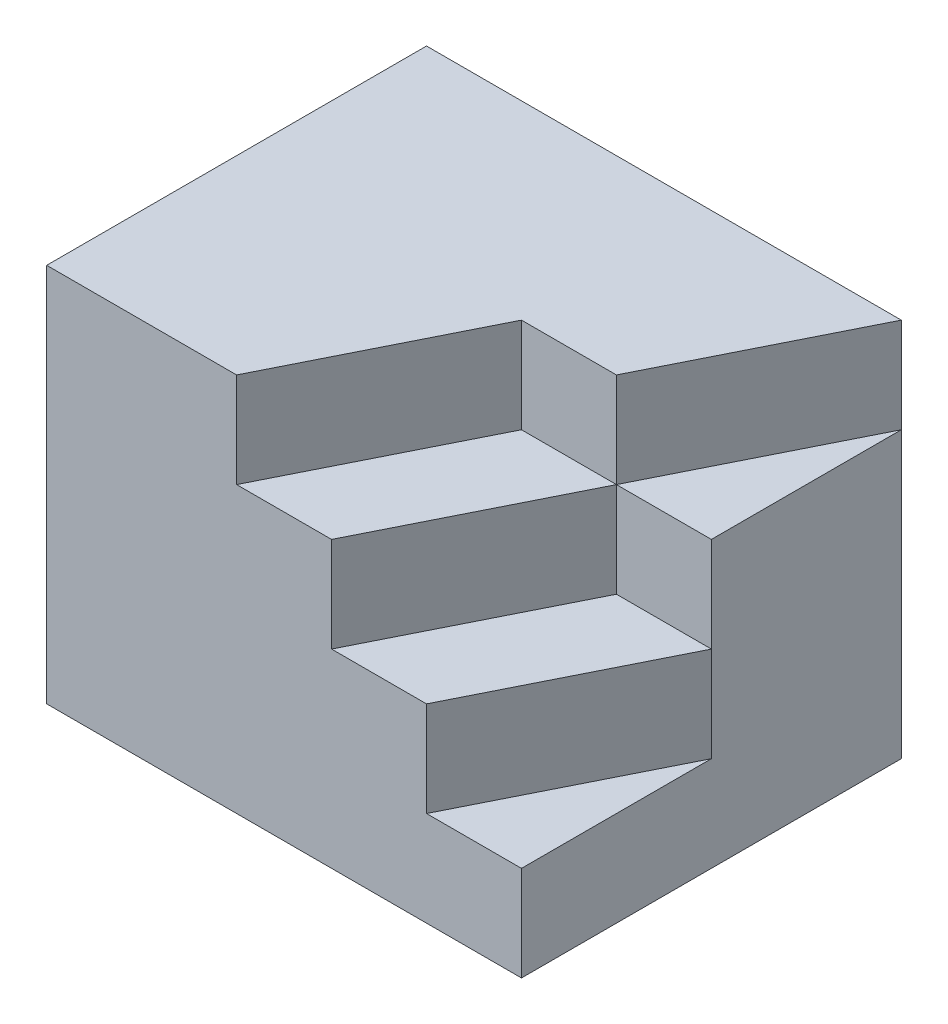
ISO-10303-21;
HEADER;
FILE_DESCRIPTION(('STEP AP214'),'2;1');
FILE_NAME('part.step','',(''),(''),'','','');
FILE_SCHEMA(('AUTOMOTIVE_DESIGN { 1 0 10303 214 1 1 1 1 }'));
ENDSEC;
DATA;
#1=APPLICATION_CONTEXT('core data for automotive mechanical design processes');
#2=APPLICATION_PROTOCOL_DEFINITION('international standard','automotive_design',2000,#1);
#3=PRODUCT_CONTEXT('',#1,'mechanical');
#4=PRODUCT('Part','Part','',(#3));
#5=PRODUCT_RELATED_PRODUCT_CATEGORY('part','',(#4));
#6=PRODUCT_DEFINITION_FORMATION('','',#4);
#7=PRODUCT_DEFINITION_CONTEXT('part definition',#1,'design');
#8=PRODUCT_DEFINITION('design','',#6,#7);
#9=PRODUCT_DEFINITION_SHAPE('','',#8);
#10=(LENGTH_UNIT() NAMED_UNIT(*) SI_UNIT(.MILLI.,.METRE.));
#11=(NAMED_UNIT(*) PLANE_ANGLE_UNIT() SI_UNIT($,.RADIAN.));
#12=(NAMED_UNIT(*) SI_UNIT($,.STERADIAN.) SOLID_ANGLE_UNIT());
#13=UNCERTAINTY_MEASURE_WITH_UNIT(LENGTH_MEASURE(1.E-05),#10,'distance_accuracy_value','');
#14=(GEOMETRIC_REPRESENTATION_CONTEXT(3) GLOBAL_UNCERTAINTY_ASSIGNED_CONTEXT((#13)) GLOBAL_UNIT_ASSIGNED_CONTEXT((#10,
#11,#12)) REPRESENTATION_CONTEXT('',''));
#15=CARTESIAN_POINT('',(0.,0.,0.));
#16=DIRECTION('',(0.,0.,1.));
#17=DIRECTION('',(1.,0.,0.));
#18=AXIS2_PLACEMENT_3D('',#15,#16,#17);
#19=CARTESIAN_POINT('',(-25.,40.,20.));
#20=DIRECTION('',(0.,0.,-1.));
#21=DIRECTION('',(-1.,0.,0.));
#22=AXIS2_PLACEMENT_3D('',#19,#20,#21);
#23=PLANE('',#22);
#24=DIRECTION('',(0.,-1.,0.));
#25=VECTOR('',#24,1.);
#26=CARTESIAN_POINT('',(-5.,146.872930440884,20.));
#27=LINE('',#26,#25);
#28=CARTESIAN_POINT('',(-5.,40.,20.));
#29=VERTEX_POINT('',#28);
#30=CARTESIAN_POINT('',(-5.,30.,20.));
#31=VERTEX_POINT('',#30);
#32=EDGE_CURVE('E126',#29,#31,#27,.T.);
#33=ORIENTED_EDGE('',*,*,#32,.F.);
#34=DIRECTION('',(1.,0.,0.));
#35=VECTOR('',#34,1.);
#36=CARTESIAN_POINT('',(-25.,40.,20.));
#37=LINE('',#36,#35);
#38=CARTESIAN_POINT('',(-25.,40.,20.));
#39=VERTEX_POINT('',#38);
#40=EDGE_CURVE('E138',#39,#29,#37,.T.);
#41=ORIENTED_EDGE('',*,*,#40,.F.);
#42=DIRECTION('',(0.,-1.,0.));
#43=VECTOR('',#42,1.);
#44=CARTESIAN_POINT('',(-25.,40.,20.));
#45=LINE('',#44,#43);
#46=CARTESIAN_POINT('',(-25.,0.,20.));
#47=VERTEX_POINT('',#46);
#48=EDGE_CURVE('E148',#39,#47,#45,.T.);
#49=ORIENTED_EDGE('',*,*,#48,.T.);
#50=DIRECTION('',(1.,0.,0.));
#51=VECTOR('',#50,1.);
#52=CARTESIAN_POINT('',(-25.,0.,20.));
#53=LINE('',#52,#51);
#54=CARTESIAN_POINT('',(25.,0.,20.));
#55=VERTEX_POINT('',#54);
#56=EDGE_CURVE('E162',#47,#55,#53,.T.);
#57=ORIENTED_EDGE('',*,*,#56,.T.);
#58=DIRECTION('',(0.,-1.,0.));
#59=VECTOR('',#58,1.);
#60=CARTESIAN_POINT('',(25.,40.,20.));
#61=LINE('',#60,#59);
#62=CARTESIAN_POINT('',(25.,10.,20.));
#63=VERTEX_POINT('',#62);
#64=EDGE_CURVE('E146',#63,#55,#61,.T.);
#65=ORIENTED_EDGE('',*,*,#64,.F.);
#66=DIRECTION('',(1.,0.,0.));
#67=VECTOR('',#66,1.);
#68=CARTESIAN_POINT('',(15.,10.,20.));
#69=LINE('',#68,#67);
#70=CARTESIAN_POINT('',(15.,10.,20.));
#71=VERTEX_POINT('',#70);
#72=EDGE_CURVE('E269',#71,#63,#69,.T.);
#73=ORIENTED_EDGE('',*,*,#72,.F.);
#74=DIRECTION('',(0.,1.,0.));
#75=VECTOR('',#74,1.);
#76=CARTESIAN_POINT('',(15.,10.,20.));
#77=LINE('',#76,#75);
#78=CARTESIAN_POINT('',(15.,20.,20.));
#79=VERTEX_POINT('',#78);
#80=EDGE_CURVE('E158',#71,#79,#77,.T.);
#81=ORIENTED_EDGE('',*,*,#80,.T.);
#82=DIRECTION('',(1.,0.,0.));
#83=VECTOR('',#82,1.);
#84=CARTESIAN_POINT('',(0.,20.,20.));
#85=LINE('',#84,#83);
#86=CARTESIAN_POINT('',(5.,20.,20.));
#87=VERTEX_POINT('',#86);
#88=EDGE_CURVE('E56',#87,#79,#85,.T.);
#89=ORIENTED_EDGE('',*,*,#88,.F.);
#90=DIRECTION('',(0.,1.,0.));
#91=VECTOR('',#90,1.);
#92=CARTESIAN_POINT('',(5.,20.,20.));
#93=LINE('',#92,#91);
#94=CARTESIAN_POINT('',(5.,30.,20.));
#95=VERTEX_POINT('',#94);
#96=EDGE_CURVE('E267',#87,#95,#93,.T.);
#97=ORIENTED_EDGE('',*,*,#96,.T.);
#98=DIRECTION('',(-1.,0.,0.));
#99=VECTOR('',#98,1.);
#100=CARTESIAN_POINT('',(-5.,30.,20.));
#101=LINE('',#100,#99);
#102=EDGE_CURVE('E48',#95,#31,#101,.T.);
#103=ORIENTED_EDGE('',*,*,#102,.T.);
#104=EDGE_LOOP('',(#33,#41,#49,#57,#65,#73,#81,#89,#97,#103));
#105=FACE_BOUND('',#104,.T.);
#106=ADVANCED_FACE('F33',(#105),#23,.F.);
#107=CARTESIAN_POINT('',(0.,40.,0.));
#108=DIRECTION('',(0.,-1.,0.));
#109=DIRECTION('',(0.,0.,-1.));
#110=AXIS2_PLACEMENT_3D('',#107,#108,#109);
#111=PLANE('',#110);
#112=DIRECTION('',(0.447213595499958,0.,-0.894427190999916));
#113=VECTOR('',#112,1.);
#114=CARTESIAN_POINT('',(5.,40.,0.));
#115=LINE('',#114,#113);
#116=CARTESIAN_POINT('',(5.,40.,0.));
#117=VERTEX_POINT('',#116);
#118=EDGE_CURVE('E122',#29,#117,#115,.T.);
#119=ORIENTED_EDGE('',*,*,#118,.T.);
#120=DIRECTION('',(1.,0.,0.));
#121=VECTOR('',#120,1.);
#122=CARTESIAN_POINT('',(15.,40.,0.));
#123=LINE('',#122,#121);
#124=CARTESIAN_POINT('',(15.,40.,0.));
#125=VERTEX_POINT('',#124);
#126=EDGE_CURVE('E132',#117,#125,#123,.T.);
#127=ORIENTED_EDGE('',*,*,#126,.T.);
#128=DIRECTION('',(-0.447213595499958,0.,0.894427190999916));
#129=VECTOR('',#128,1.);
#130=CARTESIAN_POINT('',(12.,40.,6.));
#131=LINE('',#130,#129);
#132=CARTESIAN_POINT('',(25.,40.,-20.));
#133=VERTEX_POINT('',#132);
#134=EDGE_CURVE('E256',#133,#125,#131,.T.);
#135=ORIENTED_EDGE('',*,*,#134,.F.);
#136=DIRECTION('',(-1.,0.,0.));
#137=VECTOR('',#136,1.);
#138=CARTESIAN_POINT('',(-25.,40.,-20.));
#139=LINE('',#138,#137);
#140=CARTESIAN_POINT('',(-25.,40.,-20.));
#141=VERTEX_POINT('',#140);
#142=EDGE_CURVE('E150',#133,#141,#139,.T.);
#143=ORIENTED_EDGE('',*,*,#142,.T.);
#144=DIRECTION('',(0.,0.,1.));
#145=VECTOR('',#144,1.);
#146=CARTESIAN_POINT('',(-25.,40.,20.));
#147=LINE('',#146,#145);
#148=EDGE_CURVE('E144',#141,#39,#147,.T.);
#149=ORIENTED_EDGE('',*,*,#148,.T.);
#150=ORIENTED_EDGE('',*,*,#40,.T.);
#151=EDGE_LOOP('',(#119,#127,#135,#143,#149,#150));
#152=FACE_BOUND('',#151,.T.);
#153=ADVANCED_FACE('F142',(#152),#111,.F.);
#154=CARTESIAN_POINT('',(12.,20.,6.));
#155=DIRECTION('',(-0.894427190999916,0.,-0.447213595499958));
#156=DIRECTION('',(-0.447213595499958,0.,0.894427190999916));
#157=AXIS2_PLACEMENT_3D('',#154,#155,#156);
#158=PLANE('',#157);
#159=DIRECTION('',(0.,-1.,0.));
#160=VECTOR('',#159,1.);
#161=CARTESIAN_POINT('',(15.,146.872930440884,0.));
#162=LINE('',#161,#160);
#163=CARTESIAN_POINT('',(15.,30.,0.));
#164=VERTEX_POINT('',#163);
#165=EDGE_CURVE('E238',#125,#164,#162,.T.);
#166=ORIENTED_EDGE('',*,*,#165,.T.);
#167=DIRECTION('',(-0.447213595499958,0.,0.894427190999916));
#168=VECTOR('',#167,1.);
#169=CARTESIAN_POINT('',(12.,30.,6.));
#170=LINE('',#169,#168);
#171=CARTESIAN_POINT('',(25.,30.,-20.));
#172=VERTEX_POINT('',#171);
#173=EDGE_CURVE('E253',#172,#164,#170,.T.);
#174=ORIENTED_EDGE('',*,*,#173,.F.);
#175=DIRECTION('',(0.,-1.,0.));
#176=VECTOR('',#175,1.);
#177=CARTESIAN_POINT('',(25.,40.,-20.));
#178=LINE('',#177,#176);
#179=EDGE_CURVE('E11',#133,#172,#178,.T.);
#180=ORIENTED_EDGE('',*,*,#179,.F.);
#181=ORIENTED_EDGE('',*,*,#134,.T.);
#182=EDGE_LOOP('',(#166,#174,#180,#181));
#183=FACE_BOUND('',#182,.T.);
#184=ADVANCED_FACE('F202',(#183),#158,.F.);
#185=CARTESIAN_POINT('',(25.,40.,20.));
#186=DIRECTION('',(-1.,0.,0.));
#187=DIRECTION('',(0.,0.,1.));
#188=AXIS2_PLACEMENT_3D('',#185,#186,#187);
#189=PLANE('',#188);
#190=DIRECTION('',(0.,0.,-1.));
#191=VECTOR('',#190,1.);
#192=CARTESIAN_POINT('',(25.,30.,0.));
#193=LINE('',#192,#191);
#194=CARTESIAN_POINT('',(25.,30.,0.));
#195=VERTEX_POINT('',#194);
#196=EDGE_CURVE('E251',#195,#172,#193,.T.);
#197=ORIENTED_EDGE('',*,*,#196,.F.);
#198=DIRECTION('',(0.,1.,0.));
#199=VECTOR('',#198,1.);
#200=CARTESIAN_POINT('',(25.,20.,0.));
#201=LINE('',#200,#199);
#202=CARTESIAN_POINT('',(25.,20.,0.));
#203=VERTEX_POINT('',#202);
#204=EDGE_CURVE('E265',#203,#195,#201,.T.);
#205=ORIENTED_EDGE('',*,*,#204,.F.);
#206=DIRECTION('',(0.,1.,0.));
#207=VECTOR('',#206,1.);
#208=CARTESIAN_POINT('',(25.,10.,0.));
#209=LINE('',#208,#207);
#210=CARTESIAN_POINT('',(25.,10.,0.));
#211=VERTEX_POINT('',#210);
#212=EDGE_CURVE('E280',#211,#203,#209,.T.);
#213=ORIENTED_EDGE('',*,*,#212,.F.);
#214=DIRECTION('',(0.,0.,-1.));
#215=VECTOR('',#214,1.);
#216=CARTESIAN_POINT('',(25.,10.,20.));
#217=LINE('',#216,#215);
#218=EDGE_CURVE('E185',#63,#211,#217,.T.);
#219=ORIENTED_EDGE('',*,*,#218,.F.);
#220=ORIENTED_EDGE('',*,*,#64,.T.);
#221=DIRECTION('',(0.,0.,-1.));
#222=VECTOR('',#221,1.);
#223=CARTESIAN_POINT('',(25.,0.,20.));
#224=LINE('',#223,#222);
#225=CARTESIAN_POINT('',(25.,0.,-20.));
#226=VERTEX_POINT('',#225);
#227=EDGE_CURVE('E154',#55,#226,#224,.T.);
#228=ORIENTED_EDGE('',*,*,#227,.T.);
#229=EDGE_CURVE('E41',#172,#226,#178,.T.);
#230=ORIENTED_EDGE('',*,*,#229,.F.);
#231=EDGE_LOOP('',(#197,#205,#213,#219,#220,#228,#230));
#232=FACE_BOUND('',#231,.T.);
#233=ADVANCED_FACE('F35',(#232),#189,.F.);
#234=CARTESIAN_POINT('',(0.,20.,0.));
#235=DIRECTION('',(0.,0.,-1.));
#236=DIRECTION('',(-1.,0.,0.));
#237=AXIS2_PLACEMENT_3D('',#234,#235,#236);
#238=PLANE('',#237);
#239=DIRECTION('',(-1.,0.,0.));
#240=VECTOR('',#239,1.);
#241=CARTESIAN_POINT('',(0.,30.,0.));
#242=LINE('',#241,#240);
#243=EDGE_CURVE('E140',#195,#164,#242,.T.);
#244=ORIENTED_EDGE('',*,*,#243,.T.);
#245=DIRECTION('',(0.,1.,0.));
#246=VECTOR('',#245,1.);
#247=CARTESIAN_POINT('',(15.,20.,0.));
#248=LINE('',#247,#246);
#249=CARTESIAN_POINT('',(15.,20.,0.));
#250=VERTEX_POINT('',#249);
#251=EDGE_CURVE('E270',#250,#164,#248,.T.);
#252=ORIENTED_EDGE('',*,*,#251,.F.);
#253=DIRECTION('',(-1.,0.,0.));
#254=VECTOR('',#253,1.);
#255=CARTESIAN_POINT('',(0.,20.,0.));
#256=LINE('',#255,#254);
#257=EDGE_CURVE('E259',#203,#250,#256,.T.);
#258=ORIENTED_EDGE('',*,*,#257,.F.);
#259=ORIENTED_EDGE('',*,*,#204,.T.);
#260=EDGE_LOOP('',(#244,#252,#258,#259));
#261=FACE_BOUND('',#260,.T.);
#262=ADVANCED_FACE('F207',(#261),#238,.F.);
#263=CARTESIAN_POINT('',(25.,10.,0.));
#264=DIRECTION('',(-0.894427190999916,0.,-0.447213595499958));
#265=DIRECTION('',(-0.447213595499958,0.,0.894427190999916));
#266=AXIS2_PLACEMENT_3D('',#263,#264,#265);
#267=PLANE('',#266);
#268=DIRECTION('',(0.447213595499958,0.,-0.894427190999916));
#269=VECTOR('',#268,1.);
#270=CARTESIAN_POINT('',(20.,20.,10.));
#271=LINE('',#270,#269);
#272=EDGE_CURVE('E257',#79,#203,#271,.T.);
#273=ORIENTED_EDGE('',*,*,#272,.F.);
#274=ORIENTED_EDGE('',*,*,#80,.F.);
#275=DIRECTION('',(-0.447213595499958,0.,0.894427190999916));
#276=VECTOR('',#275,1.);
#277=CARTESIAN_POINT('',(25.,10.,0.));
#278=LINE('',#277,#276);
#279=EDGE_CURVE('E277',#211,#71,#278,.T.);
#280=ORIENTED_EDGE('',*,*,#279,.F.);
#281=ORIENTED_EDGE('',*,*,#212,.T.);
#282=EDGE_LOOP('',(#273,#274,#280,#281));
#283=FACE_BOUND('',#282,.T.);
#284=ADVANCED_FACE('F196',(#283),#267,.F.);
#285=CARTESIAN_POINT('',(-25.,40.,-20.));
#286=DIRECTION('',(0.,0.,1.));
#287=DIRECTION('',(1.,0.,0.));
#288=AXIS2_PLACEMENT_3D('',#285,#286,#287);
#289=PLANE('',#288);
#290=DIRECTION('',(-1.,0.,0.));
#291=VECTOR('',#290,1.);
#292=CARTESIAN_POINT('',(-25.,0.,-20.));
#293=LINE('',#292,#291);
#294=CARTESIAN_POINT('',(-25.,0.,-20.));
#295=VERTEX_POINT('',#294);
#296=EDGE_CURVE('E157',#226,#295,#293,.T.);
#297=ORIENTED_EDGE('',*,*,#296,.T.);
#298=DIRECTION('',(0.,-1.,0.));
#299=VECTOR('',#298,1.);
#300=CARTESIAN_POINT('',(-25.,40.,-20.));
#301=LINE('',#300,#299);
#302=EDGE_CURVE('E165',#141,#295,#301,.T.);
#303=ORIENTED_EDGE('',*,*,#302,.F.);
#304=ORIENTED_EDGE('',*,*,#142,.F.);
#305=ORIENTED_EDGE('',*,*,#179,.T.);
#306=ORIENTED_EDGE('',*,*,#229,.T.);
#307=EDGE_LOOP('',(#297,#303,#304,#305,#306));
#308=FACE_BOUND('',#307,.T.);
#309=ADVANCED_FACE('F173',(#308),#289,.F.);
#310=CARTESIAN_POINT('',(-25.,40.,20.));
#311=DIRECTION('',(1.,0.,0.));
#312=DIRECTION('',(0.,0.,-1.));
#313=AXIS2_PLACEMENT_3D('',#310,#311,#312);
#314=PLANE('',#313);
#315=DIRECTION('',(0.,0.,1.));
#316=VECTOR('',#315,1.);
#317=CARTESIAN_POINT('',(-25.,0.,20.));
#318=LINE('',#317,#316);
#319=EDGE_CURVE('E160',#295,#47,#318,.T.);
#320=ORIENTED_EDGE('',*,*,#319,.T.);
#321=ORIENTED_EDGE('',*,*,#48,.F.);
#322=ORIENTED_EDGE('',*,*,#148,.F.);
#323=ORIENTED_EDGE('',*,*,#302,.T.);
#324=EDGE_LOOP('',(#320,#321,#322,#323));
#325=FACE_BOUND('',#324,.T.);
#326=ADVANCED_FACE('F187',(#325),#314,.F.);
#327=CARTESIAN_POINT('',(0.,0.,0.));
#328=DIRECTION('',(0.,-1.,0.));
#329=DIRECTION('',(0.,0.,-1.));
#330=AXIS2_PLACEMENT_3D('',#327,#328,#329);
#331=PLANE('',#330);
#332=ORIENTED_EDGE('',*,*,#227,.F.);
#333=ORIENTED_EDGE('',*,*,#56,.F.);
#334=ORIENTED_EDGE('',*,*,#319,.F.);
#335=ORIENTED_EDGE('',*,*,#296,.F.);
#336=EDGE_LOOP('',(#332,#333,#334,#335));
#337=FACE_BOUND('',#336,.T.);
#338=ADVANCED_FACE('F180',(#337),#331,.T.);
#339=CARTESIAN_POINT('',(0.,10.,0.));
#340=DIRECTION('',(0.,1.,0.));
#341=DIRECTION('',(0.,0.,1.));
#342=AXIS2_PLACEMENT_3D('',#339,#340,#341);
#343=PLANE('',#342);
#344=ORIENTED_EDGE('',*,*,#72,.T.);
#345=ORIENTED_EDGE('',*,*,#218,.T.);
#346=ORIENTED_EDGE('',*,*,#279,.T.);
#347=EDGE_LOOP('',(#344,#345,#346));
#348=FACE_BOUND('',#347,.T.);
#349=ADVANCED_FACE('F194',(#348),#343,.T.);
#350=ORIENTED_EDGE('',*,*,#251,.T.);
#351=DIRECTION('',(-0.447213595499958,0.,0.894427190999916));
#352=VECTOR('',#351,1.);
#353=CARTESIAN_POINT('',(12.,30.,6.));
#354=LINE('',#353,#352);
#355=EDGE_CURVE('E133',#164,#95,#354,.T.);
#356=ORIENTED_EDGE('',*,*,#355,.T.);
#357=ORIENTED_EDGE('',*,*,#96,.F.);
#358=DIRECTION('',(-0.447213595499958,0.,0.894427190999916));
#359=VECTOR('',#358,1.);
#360=CARTESIAN_POINT('',(12.,20.,6.));
#361=LINE('',#360,#359);
#362=EDGE_CURVE('E262',#250,#87,#361,.T.);
#363=ORIENTED_EDGE('',*,*,#362,.F.);
#364=EDGE_LOOP('',(#350,#356,#357,#363));
#365=FACE_BOUND('',#364,.T.);
#366=ADVANCED_FACE('F211',(#365),#158,.F.);
#367=CARTESIAN_POINT('',(0.,20.,0.));
#368=DIRECTION('',(0.,1.,0.));
#369=DIRECTION('',(0.,0.,1.));
#370=AXIS2_PLACEMENT_3D('',#367,#368,#369);
#371=PLANE('',#370);
#372=ORIENTED_EDGE('',*,*,#272,.T.);
#373=ORIENTED_EDGE('',*,*,#257,.T.);
#374=ORIENTED_EDGE('',*,*,#362,.T.);
#375=ORIENTED_EDGE('',*,*,#88,.T.);
#376=EDGE_LOOP('',(#372,#373,#374,#375));
#377=FACE_BOUND('',#376,.T.);
#378=ADVANCED_FACE('F218',(#377),#371,.T.);
#379=CARTESIAN_POINT('',(0.,30.,0.));
#380=DIRECTION('',(0.,1.,0.));
#381=DIRECTION('',(0.,0.,1.));
#382=AXIS2_PLACEMENT_3D('',#379,#380,#381);
#383=PLANE('',#382);
#384=ORIENTED_EDGE('',*,*,#243,.F.);
#385=ORIENTED_EDGE('',*,*,#196,.T.);
#386=ORIENTED_EDGE('',*,*,#173,.T.);
#387=EDGE_LOOP('',(#384,#385,#386));
#388=FACE_BOUND('',#387,.T.);
#389=ADVANCED_FACE('F222',(#388),#383,.T.);
#390=CARTESIAN_POINT('',(5.,146.872930440884,0.));
#391=DIRECTION('',(0.894427190999916,0.,0.447213595499958));
#392=DIRECTION('',(0.447213595499958,0.,-0.894427190999916));
#393=AXIS2_PLACEMENT_3D('',#390,#391,#392);
#394=PLANE('',#393);
#395=ORIENTED_EDGE('',*,*,#118,.F.);
#396=ORIENTED_EDGE('',*,*,#32,.T.);
#397=DIRECTION('',(0.447213595499958,0.,-0.894427190999916));
#398=VECTOR('',#397,1.);
#399=CARTESIAN_POINT('',(5.,30.,0.));
#400=LINE('',#399,#398);
#401=CARTESIAN_POINT('',(5.,30.,0.));
#402=VERTEX_POINT('',#401);
#403=EDGE_CURVE('E242',#31,#402,#400,.T.);
#404=ORIENTED_EDGE('',*,*,#403,.T.);
#405=DIRECTION('',(0.,-1.,0.));
#406=VECTOR('',#405,1.);
#407=CARTESIAN_POINT('',(5.,146.872930440884,0.));
#408=LINE('',#407,#406);
#409=EDGE_CURVE('E128',#117,#402,#408,.T.);
#410=ORIENTED_EDGE('',*,*,#409,.F.);
#411=EDGE_LOOP('',(#395,#396,#404,#410));
#412=FACE_BOUND('',#411,.T.);
#413=ADVANCED_FACE('F124',(#412),#394,.T.);
#414=CARTESIAN_POINT('',(15.,146.872930440884,0.));
#415=DIRECTION('',(0.,0.,1.));
#416=DIRECTION('',(1.,0.,0.));
#417=AXIS2_PLACEMENT_3D('',#414,#415,#416);
#418=PLANE('',#417);
#419=ORIENTED_EDGE('',*,*,#126,.F.);
#420=ORIENTED_EDGE('',*,*,#409,.T.);
#421=DIRECTION('',(1.,0.,0.));
#422=VECTOR('',#421,1.);
#423=CARTESIAN_POINT('',(15.,30.,0.));
#424=LINE('',#423,#422);
#425=EDGE_CURVE('E240',#402,#164,#424,.T.);
#426=ORIENTED_EDGE('',*,*,#425,.T.);
#427=ORIENTED_EDGE('',*,*,#165,.F.);
#428=EDGE_LOOP('',(#419,#420,#426,#427));
#429=FACE_BOUND('',#428,.T.);
#430=ADVANCED_FACE('F229',(#429),#418,.T.);
#431=CARTESIAN_POINT('',(0.,30.,0.));
#432=DIRECTION('',(0.,-1.,0.));
#433=DIRECTION('',(0.,0.,-1.));
#434=AXIS2_PLACEMENT_3D('',#431,#432,#433);
#435=PLANE('',#434);
#436=ORIENTED_EDGE('',*,*,#355,.F.);
#437=ORIENTED_EDGE('',*,*,#425,.F.);
#438=ORIENTED_EDGE('',*,*,#403,.F.);
#439=ORIENTED_EDGE('',*,*,#102,.F.);
#440=EDGE_LOOP('',(#436,#437,#438,#439));
#441=FACE_BOUND('',#440,.T.);
#442=ADVANCED_FACE('F226',(#441),#435,.F.);
#443=CLOSED_SHELL('',(#106,#153,#184,#233,#262,#284,#309,#326,#338,#349,#366,#378,#389,#413,
#430,#442));
#444=MANIFOLD_SOLID_BREP('B2',#443);
#445=ADVANCED_BREP_SHAPE_REPRESENTATION('',(#18,#444),#14);
#446=SHAPE_DEFINITION_REPRESENTATION(#9,#445);
ENDSEC;
END-ISO-10303-21;
